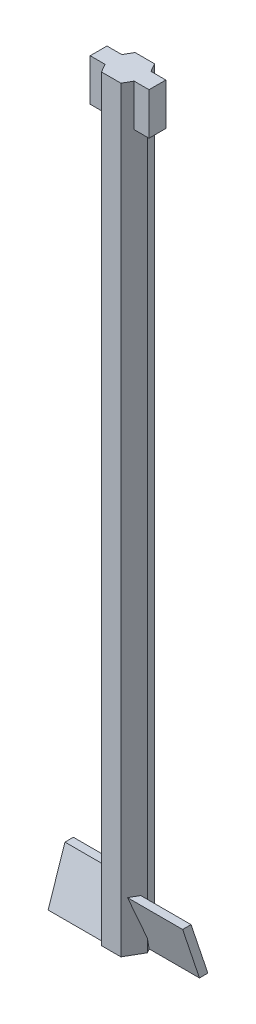
ISO-10303-21;
HEADER;
FILE_DESCRIPTION(('STEP AP214'),'2;1');
FILE_NAME('part.step','',(''),(''),'','','');
FILE_SCHEMA(('AUTOMOTIVE_DESIGN { 1 0 10303 214 1 1 1 1 }'));
ENDSEC;
DATA;
#1=APPLICATION_CONTEXT('core data for automotive mechanical design processes');
#2=APPLICATION_PROTOCOL_DEFINITION('international standard','automotive_design',2000,#1);
#3=PRODUCT_CONTEXT('',#1,'mechanical');
#4=PRODUCT('Part','Part','',(#3));
#5=PRODUCT_RELATED_PRODUCT_CATEGORY('part','',(#4));
#6=PRODUCT_DEFINITION_FORMATION('','',#4);
#7=PRODUCT_DEFINITION_CONTEXT('part definition',#1,'design');
#8=PRODUCT_DEFINITION('design','',#6,#7);
#9=PRODUCT_DEFINITION_SHAPE('','',#8);
#10=(LENGTH_UNIT() NAMED_UNIT(*) SI_UNIT(.MILLI.,.METRE.));
#11=(NAMED_UNIT(*) PLANE_ANGLE_UNIT() SI_UNIT($,.RADIAN.));
#12=(NAMED_UNIT(*) SI_UNIT($,.STERADIAN.) SOLID_ANGLE_UNIT());
#13=UNCERTAINTY_MEASURE_WITH_UNIT(LENGTH_MEASURE(1.E-05),#10,'distance_accuracy_value','');
#14=(GEOMETRIC_REPRESENTATION_CONTEXT(3) GLOBAL_UNCERTAINTY_ASSIGNED_CONTEXT((#13)) GLOBAL_UNIT_ASSIGNED_CONTEXT((#10,
#11,#12)) REPRESENTATION_CONTEXT('',''));
#15=CARTESIAN_POINT('',(0.,0.,0.));
#16=DIRECTION('',(0.,0.,1.));
#17=DIRECTION('',(1.,0.,0.));
#18=AXIS2_PLACEMENT_3D('',#15,#16,#17);
#19=CARTESIAN_POINT('',(-2.30940107675851,90.,0.));
#20=DIRECTION('',(0.866025403784443,0.,-0.499999999999993));
#21=DIRECTION('',(-0.499999999999993,0.,-0.866025403784443));
#22=AXIS2_PLACEMENT_3D('',#19,#20,#21);
#23=PLANE('',#22);
#24=DIRECTION('',(0.499999999999993,0.,0.866025403784443));
#25=VECTOR('',#24,1.);
#26=CARTESIAN_POINT('',(-2.30940107675851,0.,0.));
#27=LINE('',#26,#25);
#28=CARTESIAN_POINT('',(-2.30940107675851,0.,0.));
#29=VERTEX_POINT('',#28);
#30=CARTESIAN_POINT('',(-2.02072594216369,0.,0.5));
#31=VERTEX_POINT('',#30);
#32=EDGE_CURVE('E348',#29,#31,#27,.T.);
#33=ORIENTED_EDGE('',*,*,#32,.T.);
#34=DIRECTION('',(-0.179605302026772,0.933256525257383,-0.311085508419128));
#35=VECTOR('',#34,1.);
#36=CARTESIAN_POINT('',(-17.1435781544852,78.5806451612904,-25.6935483870968));
#37=LINE('',#36,#35);
#38=CARTESIAN_POINT('',(-2.30940107675851,1.50000000000007,0.));
#39=VERTEX_POINT('',#38);
#40=EDGE_CURVE('E234',#31,#39,#37,.T.);
#41=ORIENTED_EDGE('',*,*,#40,.T.);
#42=DIRECTION('',(0.,-1.,0.));
#43=VECTOR('',#42,1.);
#44=CARTESIAN_POINT('',(-2.30940107675851,90.,0.));
#45=LINE('',#44,#43);
#46=EDGE_CURVE('E369',#39,#29,#45,.T.);
#47=ORIENTED_EDGE('',*,*,#46,.T.);
#48=EDGE_LOOP('',(#33,#41,#47));
#49=FACE_BOUND('',#48,.T.);
#50=ADVANCED_FACE('F37',(#49),#23,.F.);
#51=CARTESIAN_POINT('',(1.15470053837924,90.,2.00000000000001));
#52=DIRECTION('',(-0.866025403784434,0.,-0.500000000000008));
#53=DIRECTION('',(-0.500000000000008,0.,0.866025403784434));
#54=AXIS2_PLACEMENT_3D('',#51,#52,#53);
#55=PLANE('',#54);
#56=DIRECTION('',(0.179605302026778,-0.933256525257382,-0.311085508419128));
#57=VECTOR('',#56,1.);
#58=CARTESIAN_POINT('',(-12.6737696188241,79.3548387096773,25.9516129032258));
#59=LINE('',#58,#57);
#60=CARTESIAN_POINT('',(1.44337567297407,6.00000000000001,1.5));
#61=VERTEX_POINT('',#60);
#62=CARTESIAN_POINT('',(2.30940107675851,1.50000000000008,0.));
#63=VERTEX_POINT('',#62);
#64=EDGE_CURVE('E60',#61,#63,#59,.T.);
#65=ORIENTED_EDGE('',*,*,#64,.F.);
#66=DIRECTION('',(-0.500000000000008,0.,0.866025403784434));
#67=VECTOR('',#66,1.);
#68=CARTESIAN_POINT('',(1.15470053837924,6.00000000000001,2.00000000000001));
#69=LINE('',#68,#67);
#70=CARTESIAN_POINT('',(2.0207259421637,6.00000000000001,0.5));
#71=VERTEX_POINT('',#70);
#72=EDGE_CURVE('E45',#71,#61,#69,.T.);
#73=ORIENTED_EDGE('',*,*,#72,.F.);
#74=DIRECTION('',(-0.179605302026778,0.933256525257382,0.311085508419128));
#75=VECTOR('',#74,1.);
#76=CARTESIAN_POINT('',(-12.1709161585622,79.7419354838709,25.0806451612903));
#77=LINE('',#76,#75);
#78=CARTESIAN_POINT('',(2.30940107675851,4.50000000000006,0.));
#79=VERTEX_POINT('',#78);
#80=EDGE_CURVE('E263',#79,#71,#77,.T.);
#81=ORIENTED_EDGE('',*,*,#80,.F.);
#82=DIRECTION('',(0.,-1.,0.));
#83=VECTOR('',#82,1.);
#84=CARTESIAN_POINT('',(2.30940107675851,90.,0.));
#85=LINE('',#84,#83);
#86=CARTESIAN_POINT('',(2.30940107675851,85.,0.));
#87=VERTEX_POINT('',#86);
#88=EDGE_CURVE('E361',#87,#79,#85,.T.);
#89=ORIENTED_EDGE('',*,*,#88,.F.);
#90=DIRECTION('',(0.500000000000008,0.,-0.866025403784434));
#91=VECTOR('',#90,1.);
#92=CARTESIAN_POINT('',(1.15470053837924,85.,2.00000000000001));
#93=LINE('',#92,#91);
#94=CARTESIAN_POINT('',(1.73205080756888,85.,1.));
#95=VERTEX_POINT('',#94);
#96=EDGE_CURVE('E318',#95,#87,#93,.T.);
#97=ORIENTED_EDGE('',*,*,#96,.F.);
#98=DIRECTION('',(0.,1.,0.));
#99=VECTOR('',#98,1.);
#100=CARTESIAN_POINT('',(1.73205080756888,90.,1.));
#101=LINE('',#100,#99);
#102=CARTESIAN_POINT('',(1.73205080756888,90.,1.));
#103=VERTEX_POINT('',#102);
#104=EDGE_CURVE('E312',#95,#103,#101,.T.);
#105=ORIENTED_EDGE('',*,*,#104,.T.);
#106=DIRECTION('',(0.500000000000008,0.,-0.866025403784434));
#107=VECTOR('',#106,1.);
#108=CARTESIAN_POINT('',(1.15470053837924,90.,2.00000000000001));
#109=LINE('',#108,#107);
#110=CARTESIAN_POINT('',(1.15470053837924,90.,2.00000000000001));
#111=VERTEX_POINT('',#110);
#112=EDGE_CURVE('E336',#111,#103,#109,.T.);
#113=ORIENTED_EDGE('',*,*,#112,.F.);
#114=DIRECTION('',(0.,-1.,0.));
#115=VECTOR('',#114,1.);
#116=CARTESIAN_POINT('',(1.15470053837924,90.,2.00000000000001));
#117=LINE('',#116,#115);
#118=CARTESIAN_POINT('',(1.15470053837924,0.,2.00000000000001));
#119=VERTEX_POINT('',#118);
#120=EDGE_CURVE('E363',#111,#119,#117,.T.);
#121=ORIENTED_EDGE('',*,*,#120,.T.);
#122=DIRECTION('',(0.500000000000008,0.,-0.866025403784434));
#123=VECTOR('',#122,1.);
#124=CARTESIAN_POINT('',(1.15470053837924,0.,2.00000000000001));
#125=LINE('',#124,#123);
#126=CARTESIAN_POINT('',(2.30940107675851,0.,0.));
#127=VERTEX_POINT('',#126);
#128=EDGE_CURVE('E353',#119,#127,#125,.T.);
#129=ORIENTED_EDGE('',*,*,#128,.T.);
#130=EDGE_CURVE('E360',#63,#127,#85,.T.);
#131=ORIENTED_EDGE('',*,*,#130,.F.);
#132=EDGE_LOOP('',(#65,#73,#81,#89,#97,#105,#113,#121,#129,#131));
#133=FACE_BOUND('',#132,.T.);
#134=ADVANCED_FACE('F394',(#133),#55,.F.);
#135=CARTESIAN_POINT('',(2.30940107675851,90.,0.));
#136=DIRECTION('',(-0.866025403784443,0.,0.499999999999992));
#137=DIRECTION('',(0.499999999999992,0.,0.866025403784443));
#138=AXIS2_PLACEMENT_3D('',#135,#136,#137);
#139=PLANE('',#138);
#140=DIRECTION('',(-0.179605302026771,-0.933256525257383,-0.311085508419128));
#141=VECTOR('',#140,1.);
#142=CARTESIAN_POINT('',(17.1435781544852,78.5806451612904,25.6935483870968));
#143=LINE('',#142,#141);
#144=CARTESIAN_POINT('',(2.02072594216369,0.,-0.5));
#145=VERTEX_POINT('',#144);
#146=EDGE_CURVE('E266',#63,#145,#143,.T.);
#147=ORIENTED_EDGE('',*,*,#146,.F.);
#148=ORIENTED_EDGE('',*,*,#130,.T.);
#149=DIRECTION('',(-0.499999999999992,0.,-0.866025403784443));
#150=VECTOR('',#149,1.);
#151=CARTESIAN_POINT('',(2.30940107675851,0.,0.));
#152=LINE('',#151,#150);
#153=EDGE_CURVE('E329',#127,#145,#152,.T.);
#154=ORIENTED_EDGE('',*,*,#153,.T.);
#155=EDGE_LOOP('',(#147,#148,#154));
#156=FACE_BOUND('',#155,.T.);
#157=ADVANCED_FACE('F432',(#156),#139,.F.);
#158=DIRECTION('',(0.179605302026771,0.933256525257383,0.311085508419128));
#159=VECTOR('',#158,1.);
#160=CARTESIAN_POINT('',(16.6407246942233,78.967741935484,24.8225806451613));
#161=LINE('',#160,#159);
#162=CARTESIAN_POINT('',(1.44337567297408,0.,-1.5));
#163=VERTEX_POINT('',#162);
#164=EDGE_CURVE('E260',#163,#79,#161,.T.);
#165=ORIENTED_EDGE('',*,*,#164,.F.);
#166=CARTESIAN_POINT('',(1.15470053837927,0.,-2.));
#167=VERTEX_POINT('',#166);
#168=EDGE_CURVE('E356',#163,#167,#152,.T.);
#169=ORIENTED_EDGE('',*,*,#168,.T.);
#170=DIRECTION('',(0.,-1.,0.));
#171=VECTOR('',#170,1.);
#172=CARTESIAN_POINT('',(1.15470053837927,90.,-2.));
#173=LINE('',#172,#171);
#174=CARTESIAN_POINT('',(1.15470053837927,90.,-2.));
#175=VERTEX_POINT('',#174);
#176=EDGE_CURVE('E341',#175,#167,#173,.T.);
#177=ORIENTED_EDGE('',*,*,#176,.F.);
#178=DIRECTION('',(-0.499999999999992,0.,-0.866025403784443));
#179=VECTOR('',#178,1.);
#180=CARTESIAN_POINT('',(2.30940107675851,90.,0.));
#181=LINE('',#180,#179);
#182=CARTESIAN_POINT('',(1.73205080756888,90.,-1.));
#183=VERTEX_POINT('',#182);
#184=EDGE_CURVE('E339',#183,#175,#181,.T.);
#185=ORIENTED_EDGE('',*,*,#184,.F.);
#186=DIRECTION('',(0.,-1.,0.));
#187=VECTOR('',#186,1.);
#188=CARTESIAN_POINT('',(1.73205080756888,90.,-1.));
#189=LINE('',#188,#187);
#190=CARTESIAN_POINT('',(1.73205080756888,85.,-1.));
#191=VERTEX_POINT('',#190);
#192=EDGE_CURVE('E300',#183,#191,#189,.T.);
#193=ORIENTED_EDGE('',*,*,#192,.T.);
#194=DIRECTION('',(-0.499999999999992,0.,-0.866025403784443));
#195=VECTOR('',#194,1.);
#196=CARTESIAN_POINT('',(2.30940107675851,85.,0.));
#197=LINE('',#196,#195);
#198=EDGE_CURVE('E376',#87,#191,#197,.T.);
#199=ORIENTED_EDGE('',*,*,#198,.F.);
#200=ORIENTED_EDGE('',*,*,#88,.T.);
#201=EDGE_LOOP('',(#165,#169,#177,#185,#193,#199,#200));
#202=FACE_BOUND('',#201,.T.);
#203=ADVANCED_FACE('F398',(#202),#139,.F.);
#204=CARTESIAN_POINT('',(1.15470053837927,90.,-2.));
#205=DIRECTION('',(0.,0.,1.));
#206=DIRECTION('',(1.,0.,0.));
#207=AXIS2_PLACEMENT_3D('',#204,#205,#206);
#208=PLANE('',#207);
#209=DIRECTION('',(-1.,0.,0.));
#210=VECTOR('',#209,1.);
#211=CARTESIAN_POINT('',(1.15470053837927,0.,-2.));
#212=LINE('',#211,#210);
#213=CARTESIAN_POINT('',(-1.15470053837924,0.,-2.00000000000002));
#214=VERTEX_POINT('',#213);
#215=EDGE_CURVE('E324',#167,#214,#212,.T.);
#216=ORIENTED_EDGE('',*,*,#215,.T.);
#217=DIRECTION('',(0.,-1.,0.));
#218=VECTOR('',#217,1.);
#219=CARTESIAN_POINT('',(-1.15470053837924,90.,-2.00000000000002));
#220=LINE('',#219,#218);
#221=CARTESIAN_POINT('',(-1.15470053837924,90.,-2.00000000000002));
#222=VERTEX_POINT('',#221);
#223=EDGE_CURVE('E373',#222,#214,#220,.T.);
#224=ORIENTED_EDGE('',*,*,#223,.F.);
#225=DIRECTION('',(-1.,0.,0.));
#226=VECTOR('',#225,1.);
#227=CARTESIAN_POINT('',(1.15470053837927,90.,-2.));
#228=LINE('',#227,#226);
#229=EDGE_CURVE('E325',#175,#222,#228,.T.);
#230=ORIENTED_EDGE('',*,*,#229,.F.);
#231=ORIENTED_EDGE('',*,*,#176,.T.);
#232=EDGE_LOOP('',(#216,#224,#230,#231));
#233=FACE_BOUND('',#232,.T.);
#234=ADVANCED_FACE('F39',(#233),#208,.F.);
#235=CARTESIAN_POINT('',(-1.15470053837924,90.,-2.00000000000002));
#236=DIRECTION('',(0.866025403784434,0.,0.500000000000008));
#237=DIRECTION('',(0.500000000000008,0.,-0.866025403784434));
#238=AXIS2_PLACEMENT_3D('',#235,#236,#237);
#239=PLANE('',#238);
#240=ORIENTED_EDGE('',*,*,#46,.F.);
#241=DIRECTION('',(0.179605302026779,0.933256525257382,-0.311085508419127));
#242=VECTOR('',#241,1.);
#243=CARTESIAN_POINT('',(12.6737696188242,79.3548387096773,-25.9516129032258));
#244=LINE('',#243,#242);
#245=CARTESIAN_POINT('',(-1.44337567297406,6.,-1.5));
#246=VERTEX_POINT('',#245);
#247=EDGE_CURVE('E237',#39,#246,#244,.T.);
#248=ORIENTED_EDGE('',*,*,#247,.T.);
#249=DIRECTION('',(-0.500000000000008,0.,0.866025403784434));
#250=VECTOR('',#249,1.);
#251=CARTESIAN_POINT('',(-1.15470053837924,6.00000000000001,-2.00000000000002));
#252=LINE('',#251,#250);
#253=CARTESIAN_POINT('',(-2.0207259421637,6.,-0.5));
#254=VERTEX_POINT('',#253);
#255=EDGE_CURVE('E11',#246,#254,#252,.T.);
#256=ORIENTED_EDGE('',*,*,#255,.T.);
#257=DIRECTION('',(-0.179605302026779,-0.933256525257382,0.311085508419127));
#258=VECTOR('',#257,1.);
#259=CARTESIAN_POINT('',(12.1709161585622,79.7419354838709,-25.0806451612903));
#260=LINE('',#259,#258);
#261=CARTESIAN_POINT('',(-2.30940107675851,4.50000000000007,0.));
#262=VERTEX_POINT('',#261);
#263=EDGE_CURVE('E231',#254,#262,#260,.T.);
#264=ORIENTED_EDGE('',*,*,#263,.T.);
#265=CARTESIAN_POINT('',(-2.30940107675851,85.,0.));
#266=VERTEX_POINT('',#265);
#267=EDGE_CURVE('E370',#266,#262,#45,.T.);
#268=ORIENTED_EDGE('',*,*,#267,.F.);
#269=DIRECTION('',(-0.500000000000008,0.,0.866025403784434));
#270=VECTOR('',#269,1.);
#271=CARTESIAN_POINT('',(-1.15470053837924,85.,-2.00000000000002));
#272=LINE('',#271,#270);
#273=CARTESIAN_POINT('',(-1.73205080756888,85.,-1.));
#274=VERTEX_POINT('',#273);
#275=EDGE_CURVE('E322',#274,#266,#272,.T.);
#276=ORIENTED_EDGE('',*,*,#275,.F.);
#277=DIRECTION('',(0.,1.,0.));
#278=VECTOR('',#277,1.);
#279=CARTESIAN_POINT('',(-1.73205080756888,90.,-1.));
#280=LINE('',#279,#278);
#281=CARTESIAN_POINT('',(-1.73205080756888,90.,-1.));
#282=VERTEX_POINT('',#281);
#283=EDGE_CURVE('E309',#274,#282,#280,.T.);
#284=ORIENTED_EDGE('',*,*,#283,.T.);
#285=DIRECTION('',(-0.500000000000008,0.,0.866025403784434));
#286=VECTOR('',#285,1.);
#287=CARTESIAN_POINT('',(-1.15470053837924,90.,-2.00000000000002));
#288=LINE('',#287,#286);
#289=EDGE_CURVE('E328',#222,#282,#288,.T.);
#290=ORIENTED_EDGE('',*,*,#289,.F.);
#291=ORIENTED_EDGE('',*,*,#223,.T.);
#292=DIRECTION('',(-0.500000000000008,0.,0.866025403784434));
#293=VECTOR('',#292,1.);
#294=CARTESIAN_POINT('',(-1.15470053837924,0.,-2.00000000000002));
#295=LINE('',#294,#293);
#296=EDGE_CURVE('E344',#214,#29,#295,.T.);
#297=ORIENTED_EDGE('',*,*,#296,.T.);
#298=EDGE_LOOP('',(#240,#248,#256,#264,#268,#276,#284,#290,#291,#297));
#299=FACE_BOUND('',#298,.T.);
#300=ADVANCED_FACE('F449',(#299),#239,.F.);
#301=ORIENTED_EDGE('',*,*,#267,.T.);
#302=DIRECTION('',(0.179605302026772,-0.933256525257383,0.311085508419128));
#303=VECTOR('',#302,1.);
#304=CARTESIAN_POINT('',(-16.6407246942233,78.967741935484,-24.8225806451613));
#305=LINE('',#304,#303);
#306=CARTESIAN_POINT('',(-1.44337567297407,0.,1.5));
#307=VERTEX_POINT('',#306);
#308=EDGE_CURVE('E227',#262,#307,#305,.T.);
#309=ORIENTED_EDGE('',*,*,#308,.T.);
#310=CARTESIAN_POINT('',(-1.15470053837927,0.,1.99999999999999));
#311=VERTEX_POINT('',#310);
#312=EDGE_CURVE('E347',#307,#311,#27,.T.);
#313=ORIENTED_EDGE('',*,*,#312,.T.);
#314=DIRECTION('',(0.,-1.,0.));
#315=VECTOR('',#314,1.);
#316=CARTESIAN_POINT('',(-1.15470053837927,90.,1.99999999999999));
#317=LINE('',#316,#315);
#318=CARTESIAN_POINT('',(-1.15470053837927,90.,1.99999999999999));
#319=VERTEX_POINT('',#318);
#320=EDGE_CURVE('E366',#319,#311,#317,.T.);
#321=ORIENTED_EDGE('',*,*,#320,.F.);
#322=DIRECTION('',(0.499999999999993,0.,0.866025403784443));
#323=VECTOR('',#322,1.);
#324=CARTESIAN_POINT('',(-2.30940107675851,90.,0.));
#325=LINE('',#324,#323);
#326=CARTESIAN_POINT('',(-1.73205080756888,90.,1.));
#327=VERTEX_POINT('',#326);
#328=EDGE_CURVE('E332',#327,#319,#325,.T.);
#329=ORIENTED_EDGE('',*,*,#328,.F.);
#330=DIRECTION('',(0.,-1.,0.));
#331=VECTOR('',#330,1.);
#332=CARTESIAN_POINT('',(-1.73205080756888,90.,1.));
#333=LINE('',#332,#331);
#334=CARTESIAN_POINT('',(-1.73205080756888,85.,1.));
#335=VERTEX_POINT('',#334);
#336=EDGE_CURVE('E315',#327,#335,#333,.T.);
#337=ORIENTED_EDGE('',*,*,#336,.T.);
#338=DIRECTION('',(0.499999999999993,0.,0.866025403784443));
#339=VECTOR('',#338,1.);
#340=CARTESIAN_POINT('',(-2.30940107675851,85.,0.));
#341=LINE('',#340,#339);
#342=EDGE_CURVE('E320',#266,#335,#341,.T.);
#343=ORIENTED_EDGE('',*,*,#342,.F.);
#344=EDGE_LOOP('',(#301,#309,#313,#321,#329,#337,#343));
#345=FACE_BOUND('',#344,.T.);
#346=ADVANCED_FACE('F444',(#345),#23,.F.);
#347=CARTESIAN_POINT('',(-1.15470053837927,90.,1.99999999999999));
#348=DIRECTION('',(0.,0.,-1.));
#349=DIRECTION('',(-1.,0.,0.));
#350=AXIS2_PLACEMENT_3D('',#347,#348,#349);
#351=PLANE('',#350);
#352=DIRECTION('',(1.,0.,0.));
#353=VECTOR('',#352,1.);
#354=CARTESIAN_POINT('',(-1.15470053837927,0.,1.99999999999999));
#355=LINE('',#354,#353);
#356=EDGE_CURVE('E351',#311,#119,#355,.T.);
#357=ORIENTED_EDGE('',*,*,#356,.T.);
#358=ORIENTED_EDGE('',*,*,#120,.F.);
#359=DIRECTION('',(1.,0.,0.));
#360=VECTOR('',#359,1.);
#361=CARTESIAN_POINT('',(-1.15470053837927,90.,1.99999999999999));
#362=LINE('',#361,#360);
#363=EDGE_CURVE('E334',#319,#111,#362,.T.);
#364=ORIENTED_EDGE('',*,*,#363,.F.);
#365=ORIENTED_EDGE('',*,*,#320,.T.);
#366=EDGE_LOOP('',(#357,#358,#364,#365));
#367=FACE_BOUND('',#366,.T.);
#368=ADVANCED_FACE('F424',(#367),#351,.F.);
#369=CARTESIAN_POINT('',(0.,90.,0.));
#370=DIRECTION('',(0.,1.,0.));
#371=DIRECTION('',(0.,0.,1.));
#372=AXIS2_PLACEMENT_3D('',#369,#370,#371);
#373=PLANE('',#372);
#374=ORIENTED_EDGE('',*,*,#289,.T.);
#375=DIRECTION('',(-1.,0.,0.));
#376=VECTOR('',#375,1.);
#377=CARTESIAN_POINT('',(-3.5,90.,-1.));
#378=LINE('',#377,#376);
#379=CARTESIAN_POINT('',(-3.5,90.,-1.));
#380=VERTEX_POINT('',#379);
#381=EDGE_CURVE('E289',#282,#380,#378,.T.);
#382=ORIENTED_EDGE('',*,*,#381,.T.);
#383=DIRECTION('',(0.,0.,1.));
#384=VECTOR('',#383,1.);
#385=CARTESIAN_POINT('',(-3.5,90.,-1.));
#386=LINE('',#385,#384);
#387=CARTESIAN_POINT('',(-3.5,90.,1.));
#388=VERTEX_POINT('',#387);
#389=EDGE_CURVE('E292',#380,#388,#386,.T.);
#390=ORIENTED_EDGE('',*,*,#389,.T.);
#391=DIRECTION('',(1.,0.,0.));
#392=VECTOR('',#391,1.);
#393=CARTESIAN_POINT('',(-3.5,90.,1.));
#394=LINE('',#393,#392);
#395=EDGE_CURVE('E275',#388,#327,#394,.T.);
#396=ORIENTED_EDGE('',*,*,#395,.T.);
#397=ORIENTED_EDGE('',*,*,#328,.T.);
#398=ORIENTED_EDGE('',*,*,#363,.T.);
#399=ORIENTED_EDGE('',*,*,#112,.T.);
#400=CARTESIAN_POINT('',(3.5,90.,1.));
#401=VERTEX_POINT('',#400);
#402=EDGE_CURVE('E295',#103,#401,#394,.T.);
#403=ORIENTED_EDGE('',*,*,#402,.T.);
#404=DIRECTION('',(0.,0.,-1.));
#405=VECTOR('',#404,1.);
#406=CARTESIAN_POINT('',(3.5,90.,-1.));
#407=LINE('',#406,#405);
#408=CARTESIAN_POINT('',(3.5,90.,-1.));
#409=VERTEX_POINT('',#408);
#410=EDGE_CURVE('E270',#401,#409,#407,.T.);
#411=ORIENTED_EDGE('',*,*,#410,.T.);
#412=EDGE_CURVE('E290',#409,#183,#378,.T.);
#413=ORIENTED_EDGE('',*,*,#412,.T.);
#414=ORIENTED_EDGE('',*,*,#184,.T.);
#415=ORIENTED_EDGE('',*,*,#229,.T.);
#416=EDGE_LOOP('',(#374,#382,#390,#396,#397,#398,#399,#403,#411,#413,#414,#415));
#417=FACE_BOUND('',#416,.T.);
#418=ADVANCED_FACE('F418',(#417),#373,.T.);
#419=CARTESIAN_POINT('',(0.,0.,0.));
#420=DIRECTION('',(0.,1.,0.));
#421=DIRECTION('',(0.,0.,1.));
#422=AXIS2_PLACEMENT_3D('',#419,#420,#421);
#423=PLANE('',#422);
#424=ORIENTED_EDGE('',*,*,#312,.F.);
#425=DIRECTION('',(1.,0.,0.));
#426=VECTOR('',#425,1.);
#427=CARTESIAN_POINT('',(-8.,0.,1.5));
#428=LINE('',#427,#426);
#429=CARTESIAN_POINT('',(-8.,0.,1.5));
#430=VERTEX_POINT('',#429);
#431=EDGE_CURVE('E52',#430,#307,#428,.T.);
#432=ORIENTED_EDGE('',*,*,#431,.F.);
#433=DIRECTION('',(0.,0.,-1.));
#434=VECTOR('',#433,1.);
#435=CARTESIAN_POINT('',(-8.,0.,1.5));
#436=LINE('',#435,#434);
#437=CARTESIAN_POINT('',(-8.,0.,0.5));
#438=VERTEX_POINT('',#437);
#439=EDGE_CURVE('E208',#430,#438,#436,.T.);
#440=ORIENTED_EDGE('',*,*,#439,.T.);
#441=DIRECTION('',(1.,0.,0.));
#442=VECTOR('',#441,1.);
#443=CARTESIAN_POINT('',(-8.,0.,0.5));
#444=LINE('',#443,#442);
#445=EDGE_CURVE('E221',#438,#31,#444,.T.);
#446=ORIENTED_EDGE('',*,*,#445,.T.);
#447=ORIENTED_EDGE('',*,*,#32,.F.);
#448=ORIENTED_EDGE('',*,*,#296,.F.);
#449=ORIENTED_EDGE('',*,*,#215,.F.);
#450=ORIENTED_EDGE('',*,*,#168,.F.);
#451=DIRECTION('',(-1.,0.,0.));
#452=VECTOR('',#451,1.);
#453=CARTESIAN_POINT('',(8.,0.,-1.5));
#454=LINE('',#453,#452);
#455=CARTESIAN_POINT('',(8.,0.,-1.5));
#456=VERTEX_POINT('',#455);
#457=EDGE_CURVE('E254',#456,#163,#454,.T.);
#458=ORIENTED_EDGE('',*,*,#457,.F.);
#459=DIRECTION('',(0.,0.,-1.));
#460=VECTOR('',#459,1.);
#461=CARTESIAN_POINT('',(8.,0.,-1.5));
#462=LINE('',#461,#460);
#463=CARTESIAN_POINT('',(8.,0.,-0.5));
#464=VERTEX_POINT('',#463);
#465=EDGE_CURVE('E242',#464,#456,#462,.T.);
#466=ORIENTED_EDGE('',*,*,#465,.F.);
#467=DIRECTION('',(-1.,0.,0.));
#468=VECTOR('',#467,1.);
#469=CARTESIAN_POINT('',(8.,0.,-0.5));
#470=LINE('',#469,#468);
#471=EDGE_CURVE('E257',#464,#145,#470,.T.);
#472=ORIENTED_EDGE('',*,*,#471,.T.);
#473=ORIENTED_EDGE('',*,*,#153,.F.);
#474=ORIENTED_EDGE('',*,*,#128,.F.);
#475=ORIENTED_EDGE('',*,*,#356,.F.);
#476=EDGE_LOOP('',(#424,#432,#440,#446,#447,#448,#449,#450,#458,#466,#472,#473,#474,#475));
#477=FACE_BOUND('',#476,.T.);
#478=ADVANCED_FACE('F430',(#477),#423,.F.);
#479=CARTESIAN_POINT('',(3.5,85.,-1.));
#480=DIRECTION('',(1.,0.,0.));
#481=DIRECTION('',(0.,0.,-1.));
#482=AXIS2_PLACEMENT_3D('',#479,#480,#481);
#483=PLANE('',#482);
#484=ORIENTED_EDGE('',*,*,#410,.F.);
#485=DIRECTION('',(0.,1.,0.));
#486=VECTOR('',#485,1.);
#487=CARTESIAN_POINT('',(3.5,85.,1.));
#488=LINE('',#487,#486);
#489=CARTESIAN_POINT('',(3.5,85.,1.));
#490=VERTEX_POINT('',#489);
#491=EDGE_CURVE('E297',#490,#401,#488,.T.);
#492=ORIENTED_EDGE('',*,*,#491,.F.);
#493=DIRECTION('',(0.,0.,-1.));
#494=VECTOR('',#493,1.);
#495=CARTESIAN_POINT('',(3.5,85.,-1.));
#496=LINE('',#495,#494);
#497=CARTESIAN_POINT('',(3.5,85.,-1.));
#498=VERTEX_POINT('',#497);
#499=EDGE_CURVE('E271',#490,#498,#496,.T.);
#500=ORIENTED_EDGE('',*,*,#499,.T.);
#501=DIRECTION('',(0.,1.,0.));
#502=VECTOR('',#501,1.);
#503=CARTESIAN_POINT('',(3.5,85.,-1.));
#504=LINE('',#503,#502);
#505=EDGE_CURVE('E286',#498,#409,#504,.T.);
#506=ORIENTED_EDGE('',*,*,#505,.T.);
#507=EDGE_LOOP('',(#484,#492,#500,#506));
#508=FACE_BOUND('',#507,.T.);
#509=ADVANCED_FACE('F412',(#508),#483,.T.);
#510=CARTESIAN_POINT('',(0.,85.,0.));
#511=DIRECTION('',(0.,1.,0.));
#512=DIRECTION('',(0.,0.,1.));
#513=AXIS2_PLACEMENT_3D('',#510,#511,#512);
#514=PLANE('',#513);
#515=DIRECTION('',(1.,0.,0.));
#516=VECTOR('',#515,1.);
#517=CARTESIAN_POINT('',(-3.5,85.,1.));
#518=LINE('',#517,#516);
#519=EDGE_CURVE('E282',#95,#490,#518,.T.);
#520=ORIENTED_EDGE('',*,*,#519,.F.);
#521=ORIENTED_EDGE('',*,*,#96,.T.);
#522=ORIENTED_EDGE('',*,*,#198,.T.);
#523=DIRECTION('',(-1.,0.,0.));
#524=VECTOR('',#523,1.);
#525=CARTESIAN_POINT('',(-3.5,85.,-1.));
#526=LINE('',#525,#524);
#527=EDGE_CURVE('E276',#498,#191,#526,.T.);
#528=ORIENTED_EDGE('',*,*,#527,.F.);
#529=ORIENTED_EDGE('',*,*,#499,.F.);
#530=EDGE_LOOP('',(#520,#521,#522,#528,#529));
#531=FACE_BOUND('',#530,.T.);
#532=ADVANCED_FACE('F405',(#531),#514,.F.);
#533=CARTESIAN_POINT('',(-3.5,85.,-1.));
#534=DIRECTION('',(0.,0.,-1.));
#535=DIRECTION('',(-1.,0.,0.));
#536=AXIS2_PLACEMENT_3D('',#533,#534,#535);
#537=PLANE('',#536);
#538=ORIENTED_EDGE('',*,*,#192,.F.);
#539=ORIENTED_EDGE('',*,*,#412,.F.);
#540=ORIENTED_EDGE('',*,*,#505,.F.);
#541=ORIENTED_EDGE('',*,*,#527,.T.);
#542=EDGE_LOOP('',(#538,#539,#540,#541));
#543=FACE_BOUND('',#542,.T.);
#544=ADVANCED_FACE('F408',(#543),#537,.T.);
#545=CARTESIAN_POINT('',(-3.5,85.,1.));
#546=DIRECTION('',(0.,0.,1.));
#547=DIRECTION('',(1.,0.,0.));
#548=AXIS2_PLACEMENT_3D('',#545,#546,#547);
#549=PLANE('',#548);
#550=ORIENTED_EDGE('',*,*,#104,.F.);
#551=ORIENTED_EDGE('',*,*,#519,.T.);
#552=ORIENTED_EDGE('',*,*,#491,.T.);
#553=ORIENTED_EDGE('',*,*,#402,.F.);
#554=EDGE_LOOP('',(#550,#551,#552,#553));
#555=FACE_BOUND('',#554,.T.);
#556=ADVANCED_FACE('F415',(#555),#549,.T.);
#557=CARTESIAN_POINT('',(-3.5,85.,-1.));
#558=VERTEX_POINT('',#557);
#559=EDGE_CURVE('E274',#274,#558,#526,.T.);
#560=ORIENTED_EDGE('',*,*,#559,.F.);
#561=ORIENTED_EDGE('',*,*,#275,.T.);
#562=ORIENTED_EDGE('',*,*,#342,.T.);
#563=CARTESIAN_POINT('',(-3.5,85.,1.));
#564=VERTEX_POINT('',#563);
#565=EDGE_CURVE('E283',#564,#335,#518,.T.);
#566=ORIENTED_EDGE('',*,*,#565,.F.);
#567=DIRECTION('',(0.,0.,1.));
#568=VECTOR('',#567,1.);
#569=CARTESIAN_POINT('',(-3.5,85.,-1.));
#570=LINE('',#569,#568);
#571=EDGE_CURVE('E279',#558,#564,#570,.T.);
#572=ORIENTED_EDGE('',*,*,#571,.F.);
#573=EDGE_LOOP('',(#560,#561,#562,#566,#572));
#574=FACE_BOUND('',#573,.T.);
#575=ADVANCED_FACE('F470',(#574),#514,.F.);
#576=ORIENTED_EDGE('',*,*,#336,.F.);
#577=ORIENTED_EDGE('',*,*,#395,.F.);
#578=DIRECTION('',(0.,1.,0.));
#579=VECTOR('',#578,1.);
#580=CARTESIAN_POINT('',(-3.5,85.,1.));
#581=LINE('',#580,#579);
#582=EDGE_CURVE('E301',#564,#388,#581,.T.);
#583=ORIENTED_EDGE('',*,*,#582,.F.);
#584=ORIENTED_EDGE('',*,*,#565,.T.);
#585=EDGE_LOOP('',(#576,#577,#583,#584));
#586=FACE_BOUND('',#585,.T.);
#587=ADVANCED_FACE('F465',(#586),#549,.T.);
#588=ORIENTED_EDGE('',*,*,#283,.F.);
#589=ORIENTED_EDGE('',*,*,#559,.T.);
#590=DIRECTION('',(0.,1.,0.));
#591=VECTOR('',#590,1.);
#592=CARTESIAN_POINT('',(-3.5,85.,-1.));
#593=LINE('',#592,#591);
#594=EDGE_CURVE('E303',#558,#380,#593,.T.);
#595=ORIENTED_EDGE('',*,*,#594,.T.);
#596=ORIENTED_EDGE('',*,*,#381,.F.);
#597=EDGE_LOOP('',(#588,#589,#595,#596));
#598=FACE_BOUND('',#597,.T.);
#599=ADVANCED_FACE('F473',(#598),#537,.T.);
#600=CARTESIAN_POINT('',(-3.5,85.,-1.));
#601=DIRECTION('',(-1.,0.,0.));
#602=DIRECTION('',(0.,0.,1.));
#603=AXIS2_PLACEMENT_3D('',#600,#601,#602);
#604=PLANE('',#603);
#605=ORIENTED_EDGE('',*,*,#389,.F.);
#606=ORIENTED_EDGE('',*,*,#594,.F.);
#607=ORIENTED_EDGE('',*,*,#571,.T.);
#608=ORIENTED_EDGE('',*,*,#582,.T.);
#609=EDGE_LOOP('',(#605,#606,#607,#608));
#610=FACE_BOUND('',#609,.T.);
#611=ADVANCED_FACE('F476',(#610),#604,.T.);
#612=CARTESIAN_POINT('',(8.,6.,1.5));
#613=DIRECTION('',(0.,-1.,0.));
#614=DIRECTION('',(0.,0.,-1.));
#615=AXIS2_PLACEMENT_3D('',#612,#613,#614);
#616=PLANE('',#615);
#617=DIRECTION('',(-1.,0.,0.));
#618=VECTOR('',#617,1.);
#619=CARTESIAN_POINT('',(8.,6.,0.5));
#620=LINE('',#619,#618);
#621=CARTESIAN_POINT('',(8.,6.,0.5));
#622=VERTEX_POINT('',#621);
#623=EDGE_CURVE('E251',#622,#71,#620,.T.);
#624=ORIENTED_EDGE('',*,*,#623,.T.);
#625=ORIENTED_EDGE('',*,*,#72,.T.);
#626=DIRECTION('',(-1.,0.,0.));
#627=VECTOR('',#626,1.);
#628=CARTESIAN_POINT('',(8.,6.,1.5));
#629=LINE('',#628,#627);
#630=CARTESIAN_POINT('',(8.,6.,1.5));
#631=VERTEX_POINT('',#630);
#632=EDGE_CURVE('E248',#631,#61,#629,.T.);
#633=ORIENTED_EDGE('',*,*,#632,.F.);
#634=DIRECTION('',(0.,0.,1.));
#635=VECTOR('',#634,1.);
#636=CARTESIAN_POINT('',(8.,6.,1.5));
#637=LINE('',#636,#635);
#638=EDGE_CURVE('E246',#622,#631,#637,.T.);
#639=ORIENTED_EDGE('',*,*,#638,.F.);
#640=EDGE_LOOP('',(#624,#625,#633,#639));
#641=FACE_BOUND('',#640,.T.);
#642=ADVANCED_FACE('F379',(#641),#616,.F.);
#643=CARTESIAN_POINT('',(8.,6.,1.5));
#644=DIRECTION('',(0.,0.316227766016838,-0.948683298050514));
#645=DIRECTION('',(0.,0.948683298050514,0.316227766016838));
#646=AXIS2_PLACEMENT_3D('',#643,#644,#645);
#647=PLANE('',#646);
#648=ORIENTED_EDGE('',*,*,#632,.T.);
#649=ORIENTED_EDGE('',*,*,#64,.T.);
#650=ORIENTED_EDGE('',*,*,#146,.T.);
#651=ORIENTED_EDGE('',*,*,#471,.F.);
#652=DIRECTION('',(0.,-0.948683298050514,-0.316227766016838));
#653=VECTOR('',#652,1.);
#654=CARTESIAN_POINT('',(8.,6.,1.5));
#655=LINE('',#654,#653);
#656=EDGE_CURVE('E239',#631,#464,#655,.T.);
#657=ORIENTED_EDGE('',*,*,#656,.F.);
#658=EDGE_LOOP('',(#648,#649,#650,#651,#657));
#659=FACE_BOUND('',#658,.T.);
#660=ADVANCED_FACE('F385',(#659),#647,.F.);
#661=CARTESIAN_POINT('',(8.,6.,0.5));
#662=DIRECTION('',(0.,-0.316227766016838,0.948683298050514));
#663=DIRECTION('',(0.,-0.948683298050514,-0.316227766016838));
#664=AXIS2_PLACEMENT_3D('',#661,#662,#663);
#665=PLANE('',#664);
#666=ORIENTED_EDGE('',*,*,#164,.T.);
#667=ORIENTED_EDGE('',*,*,#80,.T.);
#668=ORIENTED_EDGE('',*,*,#623,.F.);
#669=DIRECTION('',(0.,0.948683298050514,0.316227766016838));
#670=VECTOR('',#669,1.);
#671=CARTESIAN_POINT('',(8.,6.,0.5));
#672=LINE('',#671,#670);
#673=EDGE_CURVE('E244',#456,#622,#672,.T.);
#674=ORIENTED_EDGE('',*,*,#673,.F.);
#675=ORIENTED_EDGE('',*,*,#457,.T.);
#676=EDGE_LOOP('',(#666,#667,#668,#674,#675));
#677=FACE_BOUND('',#676,.T.);
#678=ADVANCED_FACE('F392',(#677),#665,.F.);
#679=CARTESIAN_POINT('',(8.,0.,0.));
#680=DIRECTION('',(-1.,0.,0.));
#681=DIRECTION('',(0.,0.,1.));
#682=AXIS2_PLACEMENT_3D('',#679,#680,#681);
#683=PLANE('',#682);
#684=ORIENTED_EDGE('',*,*,#656,.T.);
#685=ORIENTED_EDGE('',*,*,#465,.T.);
#686=ORIENTED_EDGE('',*,*,#673,.T.);
#687=ORIENTED_EDGE('',*,*,#638,.T.);
#688=EDGE_LOOP('',(#684,#685,#686,#687));
#689=FACE_BOUND('',#688,.T.);
#690=ADVANCED_FACE('F388',(#689),#683,.F.);
#691=CARTESIAN_POINT('',(-8.,6.,-1.5));
#692=DIRECTION('',(0.,1.,0.));
#693=DIRECTION('',(0.,0.,1.));
#694=AXIS2_PLACEMENT_3D('',#691,#692,#693);
#695=PLANE('',#694);
#696=ORIENTED_EDGE('',*,*,#255,.F.);
#697=DIRECTION('',(1.,0.,0.));
#698=VECTOR('',#697,1.);
#699=CARTESIAN_POINT('',(-8.,6.,-1.5));
#700=LINE('',#699,#698);
#701=CARTESIAN_POINT('',(-8.,6.,-1.5));
#702=VERTEX_POINT('',#701);
#703=EDGE_CURVE('E199',#702,#246,#700,.T.);
#704=ORIENTED_EDGE('',*,*,#703,.F.);
#705=DIRECTION('',(0.,0.,1.));
#706=VECTOR('',#705,1.);
#707=CARTESIAN_POINT('',(-8.,6.,-1.5));
#708=LINE('',#707,#706);
#709=CARTESIAN_POINT('',(-8.,6.,-0.5));
#710=VERTEX_POINT('',#709);
#711=EDGE_CURVE('E203',#702,#710,#708,.T.);
#712=ORIENTED_EDGE('',*,*,#711,.T.);
#713=DIRECTION('',(1.,0.,0.));
#714=VECTOR('',#713,1.);
#715=CARTESIAN_POINT('',(-8.,6.,-0.5));
#716=LINE('',#715,#714);
#717=EDGE_CURVE('E207',#710,#254,#716,.T.);
#718=ORIENTED_EDGE('',*,*,#717,.T.);
#719=EDGE_LOOP('',(#696,#704,#712,#718));
#720=FACE_BOUND('',#719,.T.);
#721=ADVANCED_FACE('F201',(#720),#695,.T.);
#722=CARTESIAN_POINT('',(-8.,6.,-1.5));
#723=DIRECTION('',(0.,-0.316227766016838,-0.948683298050514));
#724=DIRECTION('',(0.,0.948683298050514,-0.316227766016838));
#725=AXIS2_PLACEMENT_3D('',#722,#723,#724);
#726=PLANE('',#725);
#727=ORIENTED_EDGE('',*,*,#247,.F.);
#728=ORIENTED_EDGE('',*,*,#40,.F.);
#729=ORIENTED_EDGE('',*,*,#445,.F.);
#730=DIRECTION('',(0.,0.948683298050514,-0.316227766016838));
#731=VECTOR('',#730,1.);
#732=CARTESIAN_POINT('',(-8.,6.,-1.5));
#733=LINE('',#732,#731);
#734=EDGE_CURVE('E215',#438,#702,#733,.T.);
#735=ORIENTED_EDGE('',*,*,#734,.T.);
#736=ORIENTED_EDGE('',*,*,#703,.T.);
#737=EDGE_LOOP('',(#727,#728,#729,#735,#736));
#738=FACE_BOUND('',#737,.T.);
#739=ADVANCED_FACE('F219',(#738),#726,.T.);
#740=CARTESIAN_POINT('',(-8.,6.,-0.5));
#741=DIRECTION('',(0.,0.316227766016838,0.948683298050514));
#742=DIRECTION('',(0.,-0.948683298050514,0.316227766016838));
#743=AXIS2_PLACEMENT_3D('',#740,#741,#742);
#744=PLANE('',#743);
#745=ORIENTED_EDGE('',*,*,#263,.F.);
#746=ORIENTED_EDGE('',*,*,#717,.F.);
#747=DIRECTION('',(0.,-0.948683298050514,0.316227766016838));
#748=VECTOR('',#747,1.);
#749=CARTESIAN_POINT('',(-8.,6.,-0.5));
#750=LINE('',#749,#748);
#751=EDGE_CURVE('E217',#710,#430,#750,.T.);
#752=ORIENTED_EDGE('',*,*,#751,.T.);
#753=ORIENTED_EDGE('',*,*,#431,.T.);
#754=ORIENTED_EDGE('',*,*,#308,.F.);
#755=EDGE_LOOP('',(#745,#746,#752,#753,#754));
#756=FACE_BOUND('',#755,.T.);
#757=ADVANCED_FACE('F460',(#756),#744,.T.);
#758=CARTESIAN_POINT('',(-8.,0.,0.));
#759=DIRECTION('',(1.,0.,0.));
#760=DIRECTION('',(0.,0.,-1.));
#761=AXIS2_PLACEMENT_3D('',#758,#759,#760);
#762=PLANE('',#761);
#763=ORIENTED_EDGE('',*,*,#734,.F.);
#764=ORIENTED_EDGE('',*,*,#439,.F.);
#765=ORIENTED_EDGE('',*,*,#751,.F.);
#766=ORIENTED_EDGE('',*,*,#711,.F.);
#767=EDGE_LOOP('',(#763,#764,#765,#766));
#768=FACE_BOUND('',#767,.T.);
#769=ADVANCED_FACE('F213',(#768),#762,.F.);
#770=CLOSED_SHELL('',(#50,#134,#157,#203,#234,#300,#346,#368,#418,#478,#509,#532,#544,#556,#575,
#587,#599,#611,#642,#660,#678,#690,#721,#739,#757,#769));
#771=MANIFOLD_SOLID_BREP('B2',#770);
#772=ADVANCED_BREP_SHAPE_REPRESENTATION('',(#18,#771),#14);
#773=SHAPE_DEFINITION_REPRESENTATION(#9,#772);
ENDSEC;
END-ISO-10303-21;
